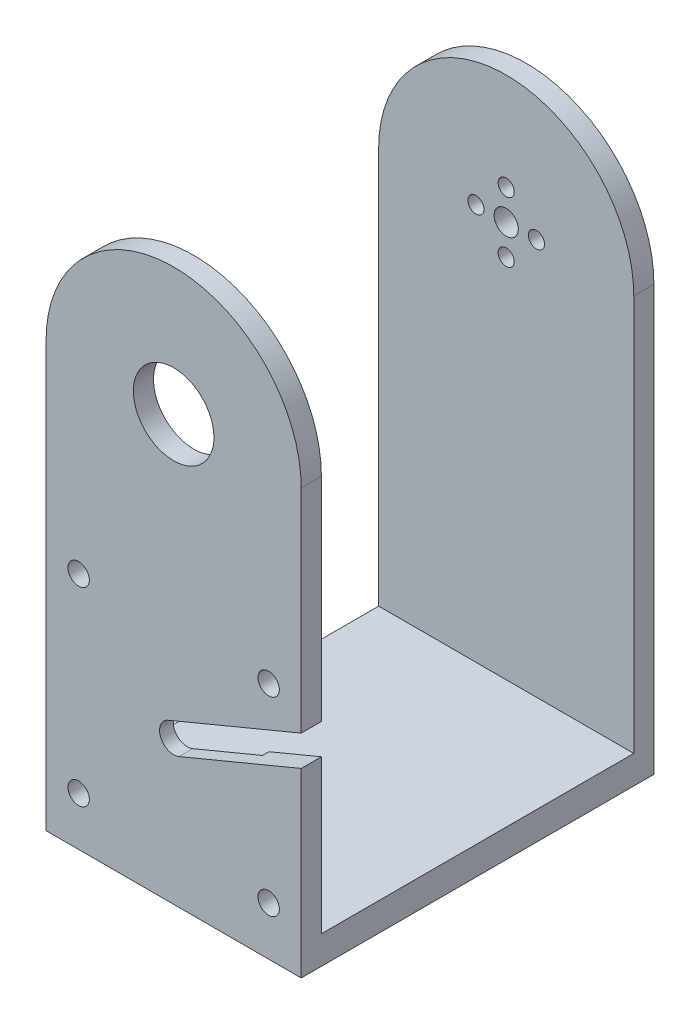
ISO-10303-21;
HEADER;
FILE_DESCRIPTION(('STEP AP214'),'2;1');
FILE_NAME('part.step','',(''),(''),'','','');
FILE_SCHEMA(('AUTOMOTIVE_DESIGN { 1 0 10303 214 1 1 1 1 }'));
ENDSEC;
DATA;
#1=APPLICATION_CONTEXT('core data for automotive mechanical design processes');
#2=APPLICATION_PROTOCOL_DEFINITION('international standard','automotive_design',2000,#1);
#3=PRODUCT_CONTEXT('',#1,'mechanical');
#4=PRODUCT('Part','Part','',(#3));
#5=PRODUCT_RELATED_PRODUCT_CATEGORY('part','',(#4));
#6=PRODUCT_DEFINITION_FORMATION('','',#4);
#7=PRODUCT_DEFINITION_CONTEXT('part definition',#1,'design');
#8=PRODUCT_DEFINITION('design','',#6,#7);
#9=PRODUCT_DEFINITION_SHAPE('','',#8);
#10=(LENGTH_UNIT() NAMED_UNIT(*) SI_UNIT(.MILLI.,.METRE.));
#11=(NAMED_UNIT(*) PLANE_ANGLE_UNIT() SI_UNIT($,.RADIAN.));
#12=(NAMED_UNIT(*) SI_UNIT($,.STERADIAN.) SOLID_ANGLE_UNIT());
#13=UNCERTAINTY_MEASURE_WITH_UNIT(LENGTH_MEASURE(1.E-05),#10,'distance_accuracy_value','');
#14=(GEOMETRIC_REPRESENTATION_CONTEXT(3) GLOBAL_UNCERTAINTY_ASSIGNED_CONTEXT((#13)) GLOBAL_UNIT_ASSIGNED_CONTEXT((#10,
#11,#12)) REPRESENTATION_CONTEXT('',''));
#15=CARTESIAN_POINT('',(0.,0.,0.));
#16=DIRECTION('',(0.,0.,1.));
#17=DIRECTION('',(1.,0.,0.));
#18=AXIS2_PLACEMENT_3D('',#15,#16,#17);
#19=CARTESIAN_POINT('',(61.7078350241144,60.3,5.));
#20=DIRECTION('',(-1.,0.,0.));
#21=DIRECTION('',(0.,0.,1.));
#22=AXIS2_PLACEMENT_3D('',#19,#20,#21);
#23=PLANE('',#22);
#24=DIRECTION('',(0.,-1.,0.));
#25=VECTOR('',#24,1.);
#26=CARTESIAN_POINT('',(61.7078350241144,60.3,5.));
#27=LINE('',#26,#25);
#28=CARTESIAN_POINT('',(61.7078350241144,98.3,5.));
#29=VERTEX_POINT('',#28);
#30=CARTESIAN_POINT('',(61.7078350241144,45.611457373675,5.));
#31=VERTEX_POINT('',#30);
#32=EDGE_CURVE('E273',#29,#31,#27,.T.);
#33=ORIENTED_EDGE('',*,*,#32,.T.);
#34=DIRECTION('',(0.,0.,1.));
#35=VECTOR('',#34,1.);
#36=CARTESIAN_POINT('',(61.7078350241144,45.611457373675,-38.683323375846));
#37=LINE('',#36,#35);
#38=CARTESIAN_POINT('',(61.7078350241144,45.611457373675,0.));
#39=VERTEX_POINT('',#38);
#40=EDGE_CURVE('E393',#39,#31,#37,.T.);
#41=ORIENTED_EDGE('',*,*,#40,.F.);
#42=DIRECTION('',(0.,-1.,0.));
#43=VECTOR('',#42,1.);
#44=CARTESIAN_POINT('',(61.7078350241144,60.3,0.));
#45=LINE('',#44,#43);
#46=CARTESIAN_POINT('',(61.7078350241144,98.3,0.));
#47=VERTEX_POINT('',#46);
#48=EDGE_CURVE('E189',#47,#39,#45,.T.);
#49=ORIENTED_EDGE('',*,*,#48,.F.);
#50=DIRECTION('',(0.,0.,1.));
#51=VECTOR('',#50,1.);
#52=CARTESIAN_POINT('',(61.7078350241144,98.3,0.));
#53=LINE('',#52,#51);
#54=EDGE_CURVE('E356',#47,#29,#53,.T.);
#55=ORIENTED_EDGE('',*,*,#54,.T.);
#56=EDGE_LOOP('',(#33,#41,#49,#55));
#57=FACE_BOUND('',#56,.T.);
#58=ADVANCED_FACE('F41',(#57),#23,.F.);
#59=CARTESIAN_POINT('',(30.0578350241144,28.65,14.8994949366117));
#60=DIRECTION('',(0.,0.,-1.));
#61=DIRECTION('',(-1.,0.,0.));
#62=AXIS2_PLACEMENT_3D('',#59,#60,#61);
#63=CYLINDRICAL_SURFACE('',#62,3.5);
#64=CARTESIAN_POINT('',(30.0578350241144,28.65,1.6));
#65=DIRECTION('',(0.,0.,-1.));
#66=DIRECTION('',(-1.,0.,0.));
#67=AXIS2_PLACEMENT_3D('',#64,#65,#66);
#68=CIRCLE('',#67,3.5);
#69=CARTESIAN_POINT('',(28.7131591065687,31.8813846377014,1.6));
#70=VERTEX_POINT('',#69);
#71=CARTESIAN_POINT('',(31.4025109416601,25.4186153622986,1.6));
#72=VERTEX_POINT('',#71);
#73=EDGE_CURVE('E192',#70,#72,#68,.F.);
#74=ORIENTED_EDGE('',*,*,#73,.F.);
#75=DIRECTION('',(0.,0.,1.));
#76=VECTOR('',#75,1.);
#77=CARTESIAN_POINT('',(28.7131591065687,31.8813846377014,-38.683323375846));
#78=LINE('',#77,#76);
#79=CARTESIAN_POINT('',(28.7131591065687,31.8813846377014,5.));
#80=VERTEX_POINT('',#79);
#81=EDGE_CURVE('E383',#70,#80,#78,.T.);
#82=ORIENTED_EDGE('',*,*,#81,.T.);
#83=CARTESIAN_POINT('',(30.0578350241144,28.65,5.));
#84=DIRECTION('',(0.,0.,1.));
#85=DIRECTION('',(1.,0.,0.));
#86=AXIS2_PLACEMENT_3D('',#83,#84,#85);
#87=CIRCLE('',#86,3.5);
#88=CARTESIAN_POINT('',(31.4025109416601,25.4186153622986,5.));
#89=VERTEX_POINT('',#88);
#90=EDGE_CURVE('E224',#89,#80,#87,.F.);
#91=ORIENTED_EDGE('',*,*,#90,.F.);
#92=DIRECTION('',(0.,0.,1.));
#93=VECTOR('',#92,1.);
#94=CARTESIAN_POINT('',(31.4025109416601,25.4186153622986,-38.683323375846));
#95=LINE('',#94,#93);
#96=EDGE_CURVE('E389',#72,#89,#95,.T.);
#97=ORIENTED_EDGE('',*,*,#96,.F.);
#98=EDGE_LOOP('',(#74,#82,#91,#97));
#99=FACE_BOUND('',#98,.T.);
#100=ADVANCED_FACE('F409',(#99),#63,.F.);
#101=CARTESIAN_POINT('',(0.,0.,0.));
#102=DIRECTION('',(0.,-1.,0.));
#103=DIRECTION('',(0.,0.,-1.));
#104=AXIS2_PLACEMENT_3D('',#101,#102,#103);
#105=PLANE('',#104);
#106=DIRECTION('',(-1.,0.,0.));
#107=VECTOR('',#106,1.);
#108=CARTESIAN_POINT('',(1.40783502411443,0.,0.));
#109=LINE('',#108,#107);
#110=CARTESIAN_POINT('',(61.7078350241144,0.,0.));
#111=VERTEX_POINT('',#110);
#112=CARTESIAN_POINT('',(-1.59216497588557,0.,0.));
#113=VERTEX_POINT('',#112);
#114=EDGE_CURVE('E262',#111,#113,#109,.T.);
#115=ORIENTED_EDGE('',*,*,#114,.F.);
#116=DIRECTION('',(0.,0.,1.));
#117=VECTOR('',#116,1.);
#118=CARTESIAN_POINT('',(61.7078350241144,0.,5.));
#119=LINE('',#118,#117);
#120=CARTESIAN_POINT('',(61.7078350241144,0.,-77.5));
#121=VERTEX_POINT('',#120);
#122=EDGE_CURVE('E171',#121,#111,#119,.T.);
#123=ORIENTED_EDGE('',*,*,#122,.F.);
#124=DIRECTION('',(1.,0.,0.));
#125=VECTOR('',#124,1.);
#126=CARTESIAN_POINT('',(-1.59216497588557,0.,-77.5));
#127=LINE('',#126,#125);
#128=CARTESIAN_POINT('',(-1.59216497588557,0.,-77.5));
#129=VERTEX_POINT('',#128);
#130=EDGE_CURVE('E254',#129,#121,#127,.T.);
#131=ORIENTED_EDGE('',*,*,#130,.F.);
#132=DIRECTION('',(0.,0.,-1.));
#133=VECTOR('',#132,1.);
#134=CARTESIAN_POINT('',(-1.59216497588557,0.,5.));
#135=LINE('',#134,#133);
#136=EDGE_CURVE('E292',#113,#129,#135,.T.);
#137=ORIENTED_EDGE('',*,*,#136,.F.);
#138=EDGE_LOOP('',(#115,#123,#131,#137));
#139=FACE_BOUND('',#138,.T.);
#140=ADVANCED_FACE('F290',(#139),#105,.F.);
#141=CARTESIAN_POINT('',(-26.5921649758856,-7.,5.));
#142=DIRECTION('',(0.,0.,1.));
#143=DIRECTION('',(1.,0.,0.));
#144=AXIS2_PLACEMENT_3D('',#141,#142,#143);
#145=PLANE('',#144);
#146=DIRECTION('',(-1.,0.,0.));
#147=VECTOR('',#146,1.);
#148=CARTESIAN_POINT('',(86.7078350241144,-7.,5.));
#149=LINE('',#148,#147);
#150=CARTESIAN_POINT('',(61.7078350241144,-7.00000000000001,5.));
#151=VERTEX_POINT('',#150);
#152=CARTESIAN_POINT('',(-1.59216497588557,-7.00000000000001,5.));
#153=VERTEX_POINT('',#152);
#154=EDGE_CURVE('E178',#151,#153,#149,.T.);
#155=ORIENTED_EDGE('',*,*,#154,.F.);
#156=CARTESIAN_POINT('',(61.7078350241144,38.0295682620688,5.));
#157=VERTEX_POINT('',#156);
#158=EDGE_CURVE('E165',#157,#151,#27,.T.);
#159=ORIENTED_EDGE('',*,*,#158,.F.);
#160=DIRECTION('',(0.923252753628975,0.384193119298765,0.));
#161=VECTOR('',#160,1.);
#162=CARTESIAN_POINT('',(31.4025109416601,25.4186153622986,5.));
#163=LINE('',#162,#161);
#164=EDGE_CURVE('E379',#89,#157,#163,.T.);
#165=ORIENTED_EDGE('',*,*,#164,.F.);
#166=ORIENTED_EDGE('',*,*,#90,.T.);
#167=DIRECTION('',(-0.923252753628975,-0.384193119298765,0.));
#168=VECTOR('',#167,1.);
#169=CARTESIAN_POINT('',(28.7131591065687,31.8813846377014,5.));
#170=LINE('',#169,#168);
#171=EDGE_CURVE('E386',#31,#80,#170,.T.);
#172=ORIENTED_EDGE('',*,*,#171,.F.);
#173=ORIENTED_EDGE('',*,*,#32,.F.);
#174=CARTESIAN_POINT('',(30.0578350241144,98.3,5.));
#175=DIRECTION('',(0.,0.,1.));
#176=DIRECTION('',(1.,0.,0.));
#177=AXIS2_PLACEMENT_3D('',#174,#175,#176);
#178=CIRCLE('',#177,31.65);
#179=CARTESIAN_POINT('',(-1.59216497588557,98.3,5.));
#180=VERTEX_POINT('',#179);
#181=EDGE_CURVE('E321',#29,#180,#178,.T.);
#182=ORIENTED_EDGE('',*,*,#181,.T.);
#183=DIRECTION('',(0.,-1.,0.));
#184=VECTOR('',#183,1.);
#185=CARTESIAN_POINT('',(-1.59216497588557,60.3,5.));
#186=LINE('',#185,#184);
#187=EDGE_CURVE('E186',#180,#153,#186,.T.);
#188=ORIENTED_EDGE('',*,*,#187,.T.);
#189=EDGE_LOOP('',(#155,#159,#165,#166,#172,#173,#182,#188));
#190=FACE_BOUND('',#189,.T.);
#191=CARTESIAN_POINT('',(30.0578350241144,98.3,5.));
#192=DIRECTION('',(0.,0.,1.));
#193=DIRECTION('',(1.,0.,0.));
#194=AXIS2_PLACEMENT_3D('',#191,#192,#193);
#195=CIRCLE('',#194,10.);
#196=CARTESIAN_POINT('',(40.0578350241144,98.3,5.));
#197=VERTEX_POINT('',#196);
#198=EDGE_CURVE('E170',#197,#197,#195,.T.);
#199=ORIENTED_EDGE('',*,*,#198,.F.);
#200=EDGE_LOOP('',(#199));
#201=FACE_BOUND('',#200,.T.);
#202=CARTESIAN_POINT('',(6.48783502411441,52.22,5.));
#203=DIRECTION('',(0.,0.,1.));
#204=DIRECTION('',(1.,0.,0.));
#205=AXIS2_PLACEMENT_3D('',#202,#203,#204);
#206=CIRCLE('',#205,2.65);
#207=CARTESIAN_POINT('',(9.13783502411442,52.22,5.));
#208=VERTEX_POINT('',#207);
#209=EDGE_CURVE('E195',#208,#208,#206,.F.);
#210=ORIENTED_EDGE('',*,*,#209,.T.);
#211=EDGE_LOOP('',(#210));
#212=FACE_BOUND('',#211,.T.);
#213=CARTESIAN_POINT('',(53.6278350241144,52.22,5.));
#214=DIRECTION('',(0.,0.,1.));
#215=DIRECTION('',(1.,0.,0.));
#216=AXIS2_PLACEMENT_3D('',#213,#214,#215);
#217=CIRCLE('',#216,2.65);
#218=CARTESIAN_POINT('',(56.2778350241144,52.22,5.));
#219=VERTEX_POINT('',#218);
#220=EDGE_CURVE('E233',#219,#219,#217,.F.);
#221=ORIENTED_EDGE('',*,*,#220,.T.);
#222=EDGE_LOOP('',(#221));
#223=FACE_BOUND('',#222,.T.);
#224=CARTESIAN_POINT('',(53.6278350241144,5.08,5.));
#225=DIRECTION('',(0.,0.,1.));
#226=DIRECTION('',(1.,0.,0.));
#227=AXIS2_PLACEMENT_3D('',#224,#225,#226);
#228=CIRCLE('',#227,2.65);
#229=CARTESIAN_POINT('',(56.2778350241144,5.08,5.));
#230=VERTEX_POINT('',#229);
#231=EDGE_CURVE('E219',#230,#230,#228,.F.);
#232=ORIENTED_EDGE('',*,*,#231,.T.);
#233=EDGE_LOOP('',(#232));
#234=FACE_BOUND('',#233,.T.);
#235=CARTESIAN_POINT('',(6.48783502411443,5.08,5.));
#236=DIRECTION('',(0.,0.,1.));
#237=DIRECTION('',(1.,0.,0.));
#238=AXIS2_PLACEMENT_3D('',#235,#236,#237);
#239=CIRCLE('',#238,2.65);
#240=CARTESIAN_POINT('',(9.13783502411443,5.08,5.));
#241=VERTEX_POINT('',#240);
#242=EDGE_CURVE('E250',#241,#241,#239,.F.);
#243=ORIENTED_EDGE('',*,*,#242,.T.);
#244=EDGE_LOOP('',(#243));
#245=FACE_BOUND('',#244,.T.);
#246=ADVANCED_FACE('F43',(#190,#201,#212,#223,#234,#245),#145,.T.);
#247=CARTESIAN_POINT('',(-1.59216497588557,-7.,-82.5));
#248=DIRECTION('',(0.,0.,-1.));
#249=DIRECTION('',(-1.,0.,0.));
#250=AXIS2_PLACEMENT_3D('',#247,#248,#249);
#251=PLANE('',#250);
#252=CARTESIAN_POINT('',(30.0578350241144,30.15,-82.5));
#253=DIRECTION('',(0.,0.,-1.));
#254=DIRECTION('',(-1.,0.,0.));
#255=AXIS2_PLACEMENT_3D('',#252,#253,#254);
#256=CIRCLE('',#255,3.5);
#257=CARTESIAN_POINT('',(26.5578350241144,30.15,-82.5));
#258=VERTEX_POINT('',#257);
#259=EDGE_CURVE('E11',#258,#258,#256,.T.);
#260=ORIENTED_EDGE('',*,*,#259,.F.);
#261=EDGE_LOOP('',(#260));
#262=FACE_BOUND('',#261,.T.);
#263=DIRECTION('',(0.,-1.,0.));
#264=VECTOR('',#263,1.);
#265=CARTESIAN_POINT('',(61.7078350241144,60.3,-82.5));
#266=LINE('',#265,#264);
#267=CARTESIAN_POINT('',(61.7078350241144,98.3,-82.5));
#268=VERTEX_POINT('',#267);
#269=CARTESIAN_POINT('',(61.7078350241144,-7.00000000000001,-82.5));
#270=VERTEX_POINT('',#269);
#271=EDGE_CURVE('E144',#268,#270,#266,.T.);
#272=ORIENTED_EDGE('',*,*,#271,.T.);
#273=DIRECTION('',(1.,0.,0.));
#274=VECTOR('',#273,1.);
#275=CARTESIAN_POINT('',(-1.59216497588557,-7.,-82.5));
#276=LINE('',#275,#274);
#277=CARTESIAN_POINT('',(-1.59216497588557,-7.00000000000001,-82.5));
#278=VERTEX_POINT('',#277);
#279=EDGE_CURVE('E149',#278,#270,#276,.T.);
#280=ORIENTED_EDGE('',*,*,#279,.F.);
#281=DIRECTION('',(0.,-1.,0.));
#282=VECTOR('',#281,1.);
#283=CARTESIAN_POINT('',(-1.59216497588557,60.3,-82.5));
#284=LINE('',#283,#282);
#285=CARTESIAN_POINT('',(-1.59216497588556,98.3,-82.5));
#286=VERTEX_POINT('',#285);
#287=EDGE_CURVE('E157',#286,#278,#284,.T.);
#288=ORIENTED_EDGE('',*,*,#287,.F.);
#289=CARTESIAN_POINT('',(30.0578350241144,98.3,-82.5));
#290=DIRECTION('',(0.,0.,-1.));
#291=DIRECTION('',(-1.,0.,0.));
#292=AXIS2_PLACEMENT_3D('',#289,#290,#291);
#293=CIRCLE('',#292,31.65);
#294=EDGE_CURVE('E151',#286,#268,#293,.T.);
#295=ORIENTED_EDGE('',*,*,#294,.T.);
#296=EDGE_LOOP('',(#272,#280,#288,#295));
#297=FACE_BOUND('',#296,.T.);
#298=CARTESIAN_POINT('',(30.0578350241144,90.8,-82.5));
#299=DIRECTION('',(0.,0.,-1.));
#300=DIRECTION('',(-1.,0.,0.));
#301=AXIS2_PLACEMENT_3D('',#298,#299,#300);
#302=CIRCLE('',#301,2.);
#303=CARTESIAN_POINT('',(28.0578350241144,90.8,-82.5));
#304=VERTEX_POINT('',#303);
#305=EDGE_CURVE('E312',#304,#304,#302,.T.);
#306=ORIENTED_EDGE('',*,*,#305,.F.);
#307=EDGE_LOOP('',(#306));
#308=FACE_BOUND('',#307,.T.);
#309=CARTESIAN_POINT('',(22.5578350241144,98.3,-82.5));
#310=DIRECTION('',(0.,0.,-1.));
#311=DIRECTION('',(-1.,0.,0.));
#312=AXIS2_PLACEMENT_3D('',#309,#310,#311);
#313=CIRCLE('',#312,2.);
#314=CARTESIAN_POINT('',(20.5578350241144,98.3,-82.5));
#315=VERTEX_POINT('',#314);
#316=EDGE_CURVE('E327',#315,#315,#313,.T.);
#317=ORIENTED_EDGE('',*,*,#316,.F.);
#318=EDGE_LOOP('',(#317));
#319=FACE_BOUND('',#318,.T.);
#320=CARTESIAN_POINT('',(30.0578350241144,98.3,-82.5));
#321=DIRECTION('',(0.,0.,-1.));
#322=DIRECTION('',(-1.,0.,0.));
#323=AXIS2_PLACEMENT_3D('',#320,#321,#322);
#324=CIRCLE('',#323,3.);
#325=CARTESIAN_POINT('',(27.0578350241144,98.3,-82.5));
#326=VERTEX_POINT('',#325);
#327=EDGE_CURVE('E326',#326,#326,#324,.T.);
#328=ORIENTED_EDGE('',*,*,#327,.F.);
#329=EDGE_LOOP('',(#328));
#330=FACE_BOUND('',#329,.T.);
#331=CARTESIAN_POINT('',(30.0578350241144,105.8,-82.5));
#332=DIRECTION('',(0.,0.,-1.));
#333=DIRECTION('',(-1.,0.,0.));
#334=AXIS2_PLACEMENT_3D('',#331,#332,#333);
#335=CIRCLE('',#334,2.);
#336=CARTESIAN_POINT('',(28.0578350241144,105.8,-82.5));
#337=VERTEX_POINT('',#336);
#338=EDGE_CURVE('E342',#337,#337,#335,.T.);
#339=ORIENTED_EDGE('',*,*,#338,.F.);
#340=EDGE_LOOP('',(#339));
#341=FACE_BOUND('',#340,.T.);
#342=CARTESIAN_POINT('',(37.5578350241144,98.3,-82.5));
#343=DIRECTION('',(0.,0.,-1.));
#344=DIRECTION('',(-1.,0.,0.));
#345=AXIS2_PLACEMENT_3D('',#342,#343,#344);
#346=CIRCLE('',#345,2.);
#347=CARTESIAN_POINT('',(35.5578350241144,98.3,-82.5));
#348=VERTEX_POINT('',#347);
#349=EDGE_CURVE('E317',#348,#348,#346,.T.);
#350=ORIENTED_EDGE('',*,*,#349,.F.);
#351=EDGE_LOOP('',(#350));
#352=FACE_BOUND('',#351,.T.);
#353=ADVANCED_FACE('F146',(#262,#297,#308,#319,#330,#341,#352),#251,.T.);
#354=CARTESIAN_POINT('',(0.,-7.,0.));
#355=DIRECTION('',(0.,-1.,0.));
#356=DIRECTION('',(0.,0.,-1.));
#357=AXIS2_PLACEMENT_3D('',#354,#355,#356);
#358=PLANE('',#357);
#359=DIRECTION('',(0.,0.,1.));
#360=VECTOR('',#359,1.);
#361=CARTESIAN_POINT('',(61.7078350241144,-7.00000000000001,5.));
#362=LINE('',#361,#360);
#363=EDGE_CURVE('E160',#270,#151,#362,.T.);
#364=ORIENTED_EDGE('',*,*,#363,.T.);
#365=ORIENTED_EDGE('',*,*,#154,.T.);
#366=DIRECTION('',(0.,0.,-1.));
#367=VECTOR('',#366,1.);
#368=CARTESIAN_POINT('',(-1.59216497588557,-7.00000000000001,5.));
#369=LINE('',#368,#367);
#370=EDGE_CURVE('E176',#153,#278,#369,.T.);
#371=ORIENTED_EDGE('',*,*,#370,.T.);
#372=ORIENTED_EDGE('',*,*,#279,.T.);
#373=EDGE_LOOP('',(#364,#365,#371,#372));
#374=FACE_BOUND('',#373,.T.);
#375=ADVANCED_FACE('F174',(#374),#358,.T.);
#376=CARTESIAN_POINT('',(1.40783502411443,60.3,0.));
#377=DIRECTION('',(0.,0.,1.));
#378=DIRECTION('',(1.,0.,0.));
#379=AXIS2_PLACEMENT_3D('',#376,#377,#378);
#380=PLANE('',#379);
#381=CARTESIAN_POINT('',(30.0578350241144,98.3,0.));
#382=DIRECTION('',(0.,0.,1.));
#383=DIRECTION('',(1.,0.,0.));
#384=AXIS2_PLACEMENT_3D('',#381,#382,#383);
#385=CIRCLE('',#384,10.);
#386=CARTESIAN_POINT('',(40.0578350241144,98.3,0.));
#387=VERTEX_POINT('',#386);
#388=EDGE_CURVE('E307',#387,#387,#385,.F.);
#389=ORIENTED_EDGE('',*,*,#388,.F.);
#390=EDGE_LOOP('',(#389));
#391=FACE_BOUND('',#390,.T.);
#392=ORIENTED_EDGE('',*,*,#48,.T.);
#393=DIRECTION('',(0.923252753628975,0.384193119298765,0.));
#394=VECTOR('',#393,1.);
#395=CARTESIAN_POINT('',(28.7131591065687,31.8813846377014,0.));
#396=LINE('',#395,#394);
#397=CARTESIAN_POINT('',(46.0017294534465,39.075676497298,0.));
#398=VERTEX_POINT('',#397);
#399=EDGE_CURVE('E380',#398,#39,#396,.T.);
#400=ORIENTED_EDGE('',*,*,#399,.F.);
#401=CARTESIAN_POINT('',(30.0578350241144,28.65,0.));
#402=DIRECTION('',(0.,0.,-1.));
#403=DIRECTION('',(-1.,0.,0.));
#404=AXIS2_PLACEMENT_3D('',#401,#402,#403);
#405=CIRCLE('',#404,19.05);
#406=CARTESIAN_POINT('',(48.6910812885379,32.6129072218952,0.));
#407=VERTEX_POINT('',#406);
#408=EDGE_CURVE('E205',#407,#398,#405,.T.);
#409=ORIENTED_EDGE('',*,*,#408,.F.);
#410=DIRECTION('',(-0.923252753628975,-0.384193119298765,0.));
#411=VECTOR('',#410,1.);
#412=CARTESIAN_POINT('',(31.4025109416601,25.4186153622986,0.));
#413=LINE('',#412,#411);
#414=CARTESIAN_POINT('',(61.7078350241144,38.0295682620688,0.));
#415=VERTEX_POINT('',#414);
#416=EDGE_CURVE('E58',#415,#407,#413,.T.);
#417=ORIENTED_EDGE('',*,*,#416,.F.);
#418=EDGE_CURVE('E270',#415,#111,#45,.T.);
#419=ORIENTED_EDGE('',*,*,#418,.T.);
#420=ORIENTED_EDGE('',*,*,#114,.T.);
#421=DIRECTION('',(0.,-1.,0.));
#422=VECTOR('',#421,1.);
#423=CARTESIAN_POINT('',(-1.59216497588557,60.3,0.));
#424=LINE('',#423,#422);
#425=CARTESIAN_POINT('',(-1.59216497588557,98.3,0.));
#426=VERTEX_POINT('',#425);
#427=EDGE_CURVE('E179',#426,#113,#424,.T.);
#428=ORIENTED_EDGE('',*,*,#427,.F.);
#429=CARTESIAN_POINT('',(30.0578350241144,98.3,0.));
#430=DIRECTION('',(0.,0.,1.));
#431=DIRECTION('',(1.,0.,0.));
#432=AXIS2_PLACEMENT_3D('',#429,#430,#431);
#433=CIRCLE('',#432,31.65);
#434=EDGE_CURVE('E352',#47,#426,#433,.T.);
#435=ORIENTED_EDGE('',*,*,#434,.F.);
#436=EDGE_LOOP('',(#392,#400,#409,#417,#419,#420,#428,#435));
#437=FACE_BOUND('',#436,.T.);
#438=CARTESIAN_POINT('',(6.48783502411441,52.22,0.));
#439=DIRECTION('',(0.,0.,-1.));
#440=DIRECTION('',(-1.,0.,0.));
#441=AXIS2_PLACEMENT_3D('',#438,#439,#440);
#442=CIRCLE('',#441,2.65);
#443=CARTESIAN_POINT('',(3.83783502411441,52.22,0.));
#444=VERTEX_POINT('',#443);
#445=EDGE_CURVE('E237',#444,#444,#442,.T.);
#446=ORIENTED_EDGE('',*,*,#445,.F.);
#447=EDGE_LOOP('',(#446));
#448=FACE_BOUND('',#447,.T.);
#449=CARTESIAN_POINT('',(53.6278350241144,52.22,0.));
#450=DIRECTION('',(0.,0.,-1.));
#451=DIRECTION('',(-1.,0.,0.));
#452=AXIS2_PLACEMENT_3D('',#449,#450,#451);
#453=CIRCLE('',#452,2.65);
#454=CARTESIAN_POINT('',(50.9778350241144,52.22,0.));
#455=VERTEX_POINT('',#454);
#456=EDGE_CURVE('E232',#455,#455,#453,.T.);
#457=ORIENTED_EDGE('',*,*,#456,.F.);
#458=EDGE_LOOP('',(#457));
#459=FACE_BOUND('',#458,.T.);
#460=CARTESIAN_POINT('',(53.6278350241144,5.08,0.));
#461=DIRECTION('',(0.,0.,-1.));
#462=DIRECTION('',(-1.,0.,0.));
#463=AXIS2_PLACEMENT_3D('',#460,#461,#462);
#464=CIRCLE('',#463,2.65);
#465=CARTESIAN_POINT('',(50.9778350241144,5.08,0.));
#466=VERTEX_POINT('',#465);
#467=EDGE_CURVE('E223',#466,#466,#464,.T.);
#468=ORIENTED_EDGE('',*,*,#467,.F.);
#469=EDGE_LOOP('',(#468));
#470=FACE_BOUND('',#469,.T.);
#471=CARTESIAN_POINT('',(6.48783502411443,5.08,0.));
#472=DIRECTION('',(0.,0.,-1.));
#473=DIRECTION('',(-1.,0.,0.));
#474=AXIS2_PLACEMENT_3D('',#471,#472,#473);
#475=CIRCLE('',#474,2.65);
#476=CARTESIAN_POINT('',(3.83783502411443,5.08,0.));
#477=VERTEX_POINT('',#476);
#478=EDGE_CURVE('E228',#477,#477,#475,.T.);
#479=ORIENTED_EDGE('',*,*,#478,.F.);
#480=EDGE_LOOP('',(#479));
#481=FACE_BOUND('',#480,.T.);
#482=ADVANCED_FACE('F287',(#391,#437,#448,#459,#470,#481),#380,.F.);
#483=CARTESIAN_POINT('',(-1.59216497588557,60.3,0.));
#484=DIRECTION('',(1.,0.,0.));
#485=DIRECTION('',(0.,0.,-1.));
#486=AXIS2_PLACEMENT_3D('',#483,#484,#485);
#487=PLANE('',#486);
#488=ORIENTED_EDGE('',*,*,#427,.T.);
#489=ORIENTED_EDGE('',*,*,#136,.T.);
#490=DIRECTION('',(0.,-1.,0.));
#491=VECTOR('',#490,1.);
#492=CARTESIAN_POINT('',(-1.59216497588557,60.3,-77.5));
#493=LINE('',#492,#491);
#494=CARTESIAN_POINT('',(-1.59216497588556,98.3,-77.5));
#495=VERTEX_POINT('',#494);
#496=EDGE_CURVE('E258',#495,#129,#493,.T.);
#497=ORIENTED_EDGE('',*,*,#496,.F.);
#498=DIRECTION('',(0.,0.,-1.));
#499=VECTOR('',#498,1.);
#500=CARTESIAN_POINT('',(-1.59216497588556,98.3,-77.5));
#501=LINE('',#500,#499);
#502=EDGE_CURVE('E370',#495,#286,#501,.T.);
#503=ORIENTED_EDGE('',*,*,#502,.T.);
#504=ORIENTED_EDGE('',*,*,#287,.T.);
#505=ORIENTED_EDGE('',*,*,#370,.F.);
#506=ORIENTED_EDGE('',*,*,#187,.F.);
#507=DIRECTION('',(0.,0.,1.));
#508=VECTOR('',#507,1.);
#509=CARTESIAN_POINT('',(-1.59216497588557,98.3,0.));
#510=LINE('',#509,#508);
#511=EDGE_CURVE('E360',#426,#180,#510,.T.);
#512=ORIENTED_EDGE('',*,*,#511,.F.);
#513=EDGE_LOOP('',(#488,#489,#497,#503,#504,#505,#506,#512));
#514=FACE_BOUND('',#513,.T.);
#515=ADVANCED_FACE('F415',(#514),#487,.F.);
#516=ORIENTED_EDGE('',*,*,#418,.F.);
#517=DIRECTION('',(0.,0.,1.));
#518=VECTOR('',#517,1.);
#519=CARTESIAN_POINT('',(61.7078350241144,38.0295682620688,-38.683323375846));
#520=LINE('',#519,#518);
#521=EDGE_CURVE('E396',#415,#157,#520,.T.);
#522=ORIENTED_EDGE('',*,*,#521,.T.);
#523=ORIENTED_EDGE('',*,*,#158,.T.);
#524=ORIENTED_EDGE('',*,*,#363,.F.);
#525=ORIENTED_EDGE('',*,*,#271,.F.);
#526=DIRECTION('',(0.,0.,-1.));
#527=VECTOR('',#526,1.);
#528=CARTESIAN_POINT('',(61.7078350241144,98.3,-77.5));
#529=LINE('',#528,#527);
#530=CARTESIAN_POINT('',(61.7078350241144,98.3,-77.5));
#531=VERTEX_POINT('',#530);
#532=EDGE_CURVE('E376',#531,#268,#529,.T.);
#533=ORIENTED_EDGE('',*,*,#532,.F.);
#534=DIRECTION('',(0.,-1.,0.));
#535=VECTOR('',#534,1.);
#536=CARTESIAN_POINT('',(61.7078350241144,60.3,-77.5));
#537=LINE('',#536,#535);
#538=EDGE_CURVE('E156',#531,#121,#537,.T.);
#539=ORIENTED_EDGE('',*,*,#538,.T.);
#540=ORIENTED_EDGE('',*,*,#122,.T.);
#541=EDGE_LOOP('',(#516,#522,#523,#524,#525,#533,#539,#540));
#542=FACE_BOUND('',#541,.T.);
#543=ADVANCED_FACE('F162',(#542),#23,.F.);
#544=CARTESIAN_POINT('',(-1.59216497588557,60.3,-77.5));
#545=DIRECTION('',(0.,0.,-1.));
#546=DIRECTION('',(-1.,0.,0.));
#547=AXIS2_PLACEMENT_3D('',#544,#545,#546);
#548=PLANE('',#547);
#549=CARTESIAN_POINT('',(30.0578350241144,90.8,-77.5));
#550=DIRECTION('',(0.,0.,-1.));
#551=DIRECTION('',(-1.,0.,0.));
#552=AXIS2_PLACEMENT_3D('',#549,#550,#551);
#553=CIRCLE('',#552,2.);
#554=CARTESIAN_POINT('',(28.0578350241144,90.8,-77.5));
#555=VERTEX_POINT('',#554);
#556=EDGE_CURVE('E316',#555,#555,#553,.F.);
#557=ORIENTED_EDGE('',*,*,#556,.F.);
#558=EDGE_LOOP('',(#557));
#559=FACE_BOUND('',#558,.T.);
#560=CARTESIAN_POINT('',(22.5578350241144,98.3,-77.5));
#561=DIRECTION('',(0.,0.,-1.));
#562=DIRECTION('',(-1.,0.,0.));
#563=AXIS2_PLACEMENT_3D('',#560,#561,#562);
#564=CIRCLE('',#563,2.);
#565=CARTESIAN_POINT('',(20.5578350241144,98.3,-77.5));
#566=VERTEX_POINT('',#565);
#567=EDGE_CURVE('E311',#566,#566,#564,.F.);
#568=ORIENTED_EDGE('',*,*,#567,.F.);
#569=EDGE_LOOP('',(#568));
#570=FACE_BOUND('',#569,.T.);
#571=CARTESIAN_POINT('',(30.0578350241144,98.3,-77.5));
#572=DIRECTION('',(0.,0.,-1.));
#573=DIRECTION('',(-1.,0.,0.));
#574=AXIS2_PLACEMENT_3D('',#571,#572,#573);
#575=CIRCLE('',#574,3.);
#576=CARTESIAN_POINT('',(27.0578350241144,98.3,-77.5));
#577=VERTEX_POINT('',#576);
#578=EDGE_CURVE('E322',#577,#577,#575,.F.);
#579=ORIENTED_EDGE('',*,*,#578,.F.);
#580=EDGE_LOOP('',(#579));
#581=FACE_BOUND('',#580,.T.);
#582=CARTESIAN_POINT('',(30.0578350241144,105.8,-77.5));
#583=DIRECTION('',(0.,0.,-1.));
#584=DIRECTION('',(-1.,0.,0.));
#585=AXIS2_PLACEMENT_3D('',#582,#583,#584);
#586=CIRCLE('',#585,2.);
#587=CARTESIAN_POINT('',(28.0578350241144,105.8,-77.5));
#588=VERTEX_POINT('',#587);
#589=EDGE_CURVE('E331',#588,#588,#586,.F.);
#590=ORIENTED_EDGE('',*,*,#589,.F.);
#591=EDGE_LOOP('',(#590));
#592=FACE_BOUND('',#591,.T.);
#593=CARTESIAN_POINT('',(37.5578350241144,98.3,-77.5));
#594=DIRECTION('',(0.,0.,-1.));
#595=DIRECTION('',(-1.,0.,0.));
#596=AXIS2_PLACEMENT_3D('',#593,#594,#595);
#597=CIRCLE('',#596,2.);
#598=CARTESIAN_POINT('',(35.5578350241144,98.3,-77.5));
#599=VERTEX_POINT('',#598);
#600=EDGE_CURVE('E338',#599,#599,#597,.F.);
#601=ORIENTED_EDGE('',*,*,#600,.F.);
#602=EDGE_LOOP('',(#601));
#603=FACE_BOUND('',#602,.T.);
#604=ORIENTED_EDGE('',*,*,#130,.T.);
#605=ORIENTED_EDGE('',*,*,#538,.F.);
#606=CARTESIAN_POINT('',(30.0578350241144,98.3,-77.5));
#607=DIRECTION('',(0.,0.,-1.));
#608=DIRECTION('',(-1.,0.,0.));
#609=AXIS2_PLACEMENT_3D('',#606,#607,#608);
#610=CIRCLE('',#609,31.65);
#611=EDGE_CURVE('E366',#495,#531,#610,.T.);
#612=ORIENTED_EDGE('',*,*,#611,.F.);
#613=ORIENTED_EDGE('',*,*,#496,.T.);
#614=EDGE_LOOP('',(#604,#605,#612,#613));
#615=FACE_BOUND('',#614,.T.);
#616=ADVANCED_FACE('F421',(#559,#570,#581,#592,#603,#615),#548,.F.);
#617=CARTESIAN_POINT('',(6.48783502411443,5.08,14.8994949366117));
#618=DIRECTION('',(0.,0.,-1.));
#619=DIRECTION('',(-1.,0.,0.));
#620=AXIS2_PLACEMENT_3D('',#617,#618,#619);
#621=CYLINDRICAL_SURFACE('',#620,2.65);
#622=ORIENTED_EDGE('',*,*,#478,.T.);
#623=EDGE_LOOP('',(#622));
#624=FACE_BOUND('',#623,.T.);
#625=ORIENTED_EDGE('',*,*,#242,.F.);
#626=EDGE_LOOP('',(#625));
#627=FACE_BOUND('',#626,.T.);
#628=ADVANCED_FACE('F423',(#624,#627),#621,.F.);
#629=CARTESIAN_POINT('',(53.6278350241144,5.08,14.8994949366117));
#630=DIRECTION('',(0.,0.,-1.));
#631=DIRECTION('',(-1.,0.,0.));
#632=AXIS2_PLACEMENT_3D('',#629,#630,#631);
#633=CYLINDRICAL_SURFACE('',#632,2.65);
#634=ORIENTED_EDGE('',*,*,#467,.T.);
#635=EDGE_LOOP('',(#634));
#636=FACE_BOUND('',#635,.T.);
#637=ORIENTED_EDGE('',*,*,#231,.F.);
#638=EDGE_LOOP('',(#637));
#639=FACE_BOUND('',#638,.T.);
#640=ADVANCED_FACE('F430',(#636,#639),#633,.F.);
#641=CARTESIAN_POINT('',(53.6278350241144,52.22,14.8994949366117));
#642=DIRECTION('',(0.,0.,-1.));
#643=DIRECTION('',(-1.,0.,0.));
#644=AXIS2_PLACEMENT_3D('',#641,#642,#643);
#645=CYLINDRICAL_SURFACE('',#644,2.65);
#646=ORIENTED_EDGE('',*,*,#456,.T.);
#647=EDGE_LOOP('',(#646));
#648=FACE_BOUND('',#647,.T.);
#649=ORIENTED_EDGE('',*,*,#220,.F.);
#650=EDGE_LOOP('',(#649));
#651=FACE_BOUND('',#650,.T.);
#652=ADVANCED_FACE('F507',(#648,#651),#645,.F.);
#653=CARTESIAN_POINT('',(6.48783502411441,52.22,14.8994949366117));
#654=DIRECTION('',(0.,0.,-1.));
#655=DIRECTION('',(-1.,0.,0.));
#656=AXIS2_PLACEMENT_3D('',#653,#654,#655);
#657=CYLINDRICAL_SURFACE('',#656,2.65);
#658=ORIENTED_EDGE('',*,*,#445,.T.);
#659=EDGE_LOOP('',(#658));
#660=FACE_BOUND('',#659,.T.);
#661=ORIENTED_EDGE('',*,*,#209,.F.);
#662=EDGE_LOOP('',(#661));
#663=FACE_BOUND('',#662,.T.);
#664=ADVANCED_FACE('F503',(#660,#663),#657,.F.);
#665=CARTESIAN_POINT('',(30.0578350241144,28.65,1.6));
#666=DIRECTION('',(0.,0.,-1.));
#667=DIRECTION('',(-1.,0.,0.));
#668=AXIS2_PLACEMENT_3D('',#665,#666,#667);
#669=PLANE('',#668);
#670=DIRECTION('',(0.923252753628975,0.384193119298765,0.));
#671=VECTOR('',#670,1.);
#672=CARTESIAN_POINT('',(28.7131591065687,31.8813846377014,1.6));
#673=LINE('',#672,#671);
#674=CARTESIAN_POINT('',(46.0017294534465,39.075676497298,1.6));
#675=VERTEX_POINT('',#674);
#676=EDGE_CURVE('E66',#70,#675,#673,.T.);
#677=ORIENTED_EDGE('',*,*,#676,.F.);
#678=ORIENTED_EDGE('',*,*,#73,.T.);
#679=DIRECTION('',(-0.923252753628975,-0.384193119298765,0.));
#680=VECTOR('',#679,1.);
#681=CARTESIAN_POINT('',(31.4025109416601,25.4186153622986,1.6));
#682=LINE('',#681,#680);
#683=CARTESIAN_POINT('',(48.6910812885379,32.6129072218952,1.6));
#684=VERTEX_POINT('',#683);
#685=EDGE_CURVE('E211',#684,#72,#682,.T.);
#686=ORIENTED_EDGE('',*,*,#685,.F.);
#687=CARTESIAN_POINT('',(30.0578350241144,28.65,1.6));
#688=DIRECTION('',(0.,0.,-1.));
#689=DIRECTION('',(-1.,0.,0.));
#690=AXIS2_PLACEMENT_3D('',#687,#688,#689);
#691=CIRCLE('',#690,19.05);
#692=EDGE_CURVE('E196',#684,#675,#691,.T.);
#693=ORIENTED_EDGE('',*,*,#692,.T.);
#694=EDGE_LOOP('',(#677,#678,#686,#693));
#695=FACE_BOUND('',#694,.T.);
#696=ADVANCED_FACE('F209',(#695),#669,.T.);
#697=CARTESIAN_POINT('',(30.0578350241144,28.65,1.6));
#698=DIRECTION('',(0.,0.,-1.));
#699=DIRECTION('',(-1.,0.,0.));
#700=AXIS2_PLACEMENT_3D('',#697,#698,#699);
#701=CYLINDRICAL_SURFACE('',#700,19.05);
#702=ORIENTED_EDGE('',*,*,#408,.T.);
#703=DIRECTION('',(0.,0.,-1.));
#704=VECTOR('',#703,1.);
#705=CARTESIAN_POINT('',(46.0017294534465,39.075676497298,1.6));
#706=LINE('',#705,#704);
#707=EDGE_CURVE('E45',#398,#675,#706,.F.);
#708=ORIENTED_EDGE('',*,*,#707,.T.);
#709=ORIENTED_EDGE('',*,*,#692,.F.);
#710=DIRECTION('',(0.,0.,-1.));
#711=VECTOR('',#710,1.);
#712=CARTESIAN_POINT('',(48.6910812885379,32.6129072218952,1.6));
#713=LINE('',#712,#711);
#714=EDGE_CURVE('E183',#684,#407,#713,.T.);
#715=ORIENTED_EDGE('',*,*,#714,.T.);
#716=EDGE_LOOP('',(#702,#708,#709,#715));
#717=FACE_BOUND('',#716,.T.);
#718=ADVANCED_FACE('F204',(#717),#701,.F.);
#719=CARTESIAN_POINT('',(31.4025109416601,25.4186153622986,-38.683323375846));
#720=DIRECTION('',(0.384193119298765,-0.923252753628975,0.));
#721=DIRECTION('',(0.923252753628975,0.384193119298765,0.));
#722=AXIS2_PLACEMENT_3D('',#719,#720,#721);
#723=PLANE('',#722);
#724=ORIENTED_EDGE('',*,*,#685,.T.);
#725=ORIENTED_EDGE('',*,*,#96,.T.);
#726=ORIENTED_EDGE('',*,*,#164,.T.);
#727=ORIENTED_EDGE('',*,*,#521,.F.);
#728=ORIENTED_EDGE('',*,*,#416,.T.);
#729=ORIENTED_EDGE('',*,*,#714,.F.);
#730=EDGE_LOOP('',(#724,#725,#726,#727,#728,#729));
#731=FACE_BOUND('',#730,.T.);
#732=ADVANCED_FACE('F405',(#731),#723,.F.);
#733=CARTESIAN_POINT('',(28.7131591065687,31.8813846377014,-38.683323375846));
#734=DIRECTION('',(-0.384193119298765,0.923252753628975,0.));
#735=DIRECTION('',(-0.923252753628975,-0.384193119298765,0.));
#736=AXIS2_PLACEMENT_3D('',#733,#734,#735);
#737=PLANE('',#736);
#738=ORIENTED_EDGE('',*,*,#676,.T.);
#739=ORIENTED_EDGE('',*,*,#707,.F.);
#740=ORIENTED_EDGE('',*,*,#399,.T.);
#741=ORIENTED_EDGE('',*,*,#40,.T.);
#742=ORIENTED_EDGE('',*,*,#171,.T.);
#743=ORIENTED_EDGE('',*,*,#81,.F.);
#744=EDGE_LOOP('',(#738,#739,#740,#741,#742,#743));
#745=FACE_BOUND('',#744,.T.);
#746=ADVANCED_FACE('F496',(#745),#737,.F.);
#747=CARTESIAN_POINT('',(30.0578350241144,98.3,-77.5));
#748=DIRECTION('',(0.,0.,-1.));
#749=DIRECTION('',(-1.,0.,0.));
#750=AXIS2_PLACEMENT_3D('',#747,#748,#749);
#751=CYLINDRICAL_SURFACE('',#750,31.65);
#752=ORIENTED_EDGE('',*,*,#294,.F.);
#753=ORIENTED_EDGE('',*,*,#502,.F.);
#754=ORIENTED_EDGE('',*,*,#611,.T.);
#755=ORIENTED_EDGE('',*,*,#532,.T.);
#756=EDGE_LOOP('',(#752,#753,#754,#755));
#757=FACE_BOUND('',#756,.T.);
#758=ADVANCED_FACE('F419',(#757),#751,.T.);
#759=CARTESIAN_POINT('',(30.0578350241144,98.3,0.));
#760=DIRECTION('',(0.,0.,1.));
#761=DIRECTION('',(1.,0.,0.));
#762=AXIS2_PLACEMENT_3D('',#759,#760,#761);
#763=CYLINDRICAL_SURFACE('',#762,31.65);
#764=ORIENTED_EDGE('',*,*,#181,.F.);
#765=ORIENTED_EDGE('',*,*,#54,.F.);
#766=ORIENTED_EDGE('',*,*,#434,.T.);
#767=ORIENTED_EDGE('',*,*,#511,.T.);
#768=EDGE_LOOP('',(#764,#765,#766,#767));
#769=FACE_BOUND('',#768,.T.);
#770=ADVANCED_FACE('F486',(#769),#763,.T.);
#771=CARTESIAN_POINT('',(37.5578350241144,98.3,-69.0147186257614));
#772=DIRECTION('',(0.,0.,-1.));
#773=DIRECTION('',(-1.,0.,0.));
#774=AXIS2_PLACEMENT_3D('',#771,#772,#773);
#775=CYLINDRICAL_SURFACE('',#774,2.);
#776=ORIENTED_EDGE('',*,*,#600,.T.);
#777=EDGE_LOOP('',(#776));
#778=FACE_BOUND('',#777,.T.);
#779=ORIENTED_EDGE('',*,*,#349,.T.);
#780=EDGE_LOOP('',(#779));
#781=FACE_BOUND('',#780,.T.);
#782=ADVANCED_FACE('F483',(#778,#781),#775,.F.);
#783=CARTESIAN_POINT('',(30.0578350241144,105.8,-69.0147186257614));
#784=DIRECTION('',(0.,0.,-1.));
#785=DIRECTION('',(-1.,0.,0.));
#786=AXIS2_PLACEMENT_3D('',#783,#784,#785);
#787=CYLINDRICAL_SURFACE('',#786,2.);
#788=ORIENTED_EDGE('',*,*,#589,.T.);
#789=EDGE_LOOP('',(#788));
#790=FACE_BOUND('',#789,.T.);
#791=ORIENTED_EDGE('',*,*,#338,.T.);
#792=EDGE_LOOP('',(#791));
#793=FACE_BOUND('',#792,.T.);
#794=ADVANCED_FACE('F478',(#790,#793),#787,.F.);
#795=CARTESIAN_POINT('',(30.0578350241144,98.3,-69.0147186257614));
#796=DIRECTION('',(0.,0.,-1.));
#797=DIRECTION('',(-1.,0.,0.));
#798=AXIS2_PLACEMENT_3D('',#795,#796,#797);
#799=CYLINDRICAL_SURFACE('',#798,3.);
#800=ORIENTED_EDGE('',*,*,#578,.T.);
#801=EDGE_LOOP('',(#800));
#802=FACE_BOUND('',#801,.T.);
#803=ORIENTED_EDGE('',*,*,#327,.T.);
#804=EDGE_LOOP('',(#803));
#805=FACE_BOUND('',#804,.T.);
#806=ADVANCED_FACE('F475',(#802,#805),#799,.F.);
#807=CARTESIAN_POINT('',(22.5578350241144,98.3,-69.0147186257614));
#808=DIRECTION('',(0.,0.,-1.));
#809=DIRECTION('',(-1.,0.,0.));
#810=AXIS2_PLACEMENT_3D('',#807,#808,#809);
#811=CYLINDRICAL_SURFACE('',#810,2.);
#812=ORIENTED_EDGE('',*,*,#567,.T.);
#813=EDGE_LOOP('',(#812));
#814=FACE_BOUND('',#813,.T.);
#815=ORIENTED_EDGE('',*,*,#316,.T.);
#816=EDGE_LOOP('',(#815));
#817=FACE_BOUND('',#816,.T.);
#818=ADVANCED_FACE('F473',(#814,#817),#811,.F.);
#819=CARTESIAN_POINT('',(30.0578350241144,90.8,-69.0147186257614));
#820=DIRECTION('',(0.,0.,-1.));
#821=DIRECTION('',(-1.,0.,0.));
#822=AXIS2_PLACEMENT_3D('',#819,#820,#821);
#823=CYLINDRICAL_SURFACE('',#822,2.);
#824=ORIENTED_EDGE('',*,*,#556,.T.);
#825=EDGE_LOOP('',(#824));
#826=FACE_BOUND('',#825,.T.);
#827=ORIENTED_EDGE('',*,*,#305,.T.);
#828=EDGE_LOOP('',(#827));
#829=FACE_BOUND('',#828,.T.);
#830=ADVANCED_FACE('F469',(#826,#829),#823,.F.);
#831=CARTESIAN_POINT('',(30.0578350241144,98.3,-28.2842712474619));
#832=DIRECTION('',(0.,0.,1.));
#833=DIRECTION('',(1.,0.,0.));
#834=AXIS2_PLACEMENT_3D('',#831,#832,#833);
#835=CYLINDRICAL_SURFACE('',#834,10.);
#836=ORIENTED_EDGE('',*,*,#388,.T.);
#837=EDGE_LOOP('',(#836));
#838=FACE_BOUND('',#837,.T.);
#839=ORIENTED_EDGE('',*,*,#198,.T.);
#840=EDGE_LOOP('',(#839));
#841=FACE_BOUND('',#840,.T.);
#842=ADVANCED_FACE('F458',(#838,#841),#835,.F.);
#843=CARTESIAN_POINT('',(30.0578350241144,30.15,-97.5));
#844=DIRECTION('',(0.,0.,1.));
#845=DIRECTION('',(1.,0.,0.));
#846=AXIS2_PLACEMENT_3D('',#843,#844,#845);
#847=CYLINDRICAL_SURFACE('',#846,3.5);
#848=ORIENTED_EDGE('',*,*,#259,.T.);
#849=EDGE_LOOP('',(#848));
#850=FACE_BOUND('',#849,.T.);
#851=CARTESIAN_POINT('',(30.0578350241144,30.15,-97.5));
#852=DIRECTION('',(0.,0.,1.));
#853=DIRECTION('',(1.,0.,0.));
#854=AXIS2_PLACEMENT_3D('',#851,#852,#853);
#855=CIRCLE('',#854,3.5);
#856=CARTESIAN_POINT('',(33.5578350241144,30.15,-97.5));
#857=VERTEX_POINT('',#856);
#858=EDGE_CURVE('E295',#857,#857,#855,.T.);
#859=ORIENTED_EDGE('',*,*,#858,.T.);
#860=EDGE_LOOP('',(#859));
#861=FACE_BOUND('',#860,.T.);
#862=ADVANCED_FACE('F454',(#850,#861),#847,.T.);
#863=CARTESIAN_POINT('',(30.0578350241144,30.15,-97.5));
#864=DIRECTION('',(0.,0.,1.));
#865=DIRECTION('',(1.,0.,0.));
#866=AXIS2_PLACEMENT_3D('',#863,#864,#865);
#867=PLANE('',#866);
#868=ORIENTED_EDGE('',*,*,#858,.F.);
#869=EDGE_LOOP('',(#868));
#870=FACE_BOUND('',#869,.T.);
#871=ADVANCED_FACE('F457',(#870),#867,.F.);
#872=CLOSED_SHELL('',(#58,#100,#140,#246,#353,#375,#482,#515,#543,#616,#628,#640,#652,#664,#696,
#718,#732,#746,#758,#770,#782,#794,#806,#818,#830,#842,#862,#871));
#873=MANIFOLD_SOLID_BREP('B2',#872);
#874=ADVANCED_BREP_SHAPE_REPRESENTATION('',(#18,#873),#14);
#875=SHAPE_DEFINITION_REPRESENTATION(#9,#874);
ENDSEC;
END-ISO-10303-21;
